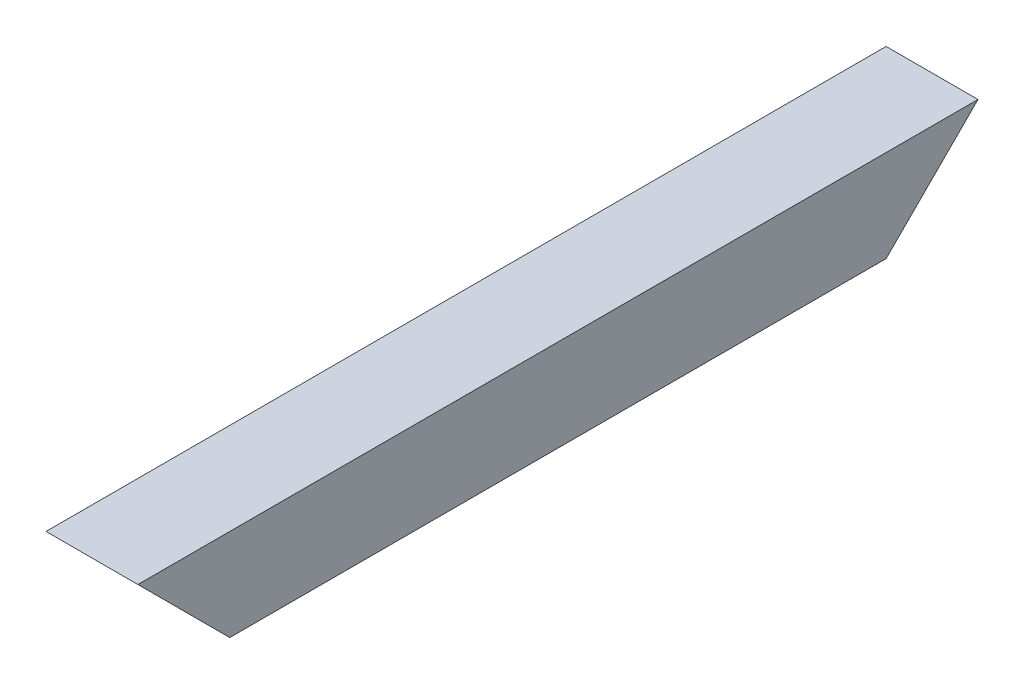
ISO-10303-21;
HEADER;
FILE_DESCRIPTION(('STEP AP214'),'2;1');
FILE_NAME('part.step','',(''),(''),'','','');
FILE_SCHEMA(('AUTOMOTIVE_DESIGN { 1 0 10303 214 1 1 1 1 }'));
ENDSEC;
DATA;
#1=APPLICATION_CONTEXT('core data for automotive mechanical design processes');
#2=APPLICATION_PROTOCOL_DEFINITION('international standard','automotive_design',2000,#1);
#3=PRODUCT_CONTEXT('',#1,'mechanical');
#4=PRODUCT('Part','Part','',(#3));
#5=PRODUCT_RELATED_PRODUCT_CATEGORY('part','',(#4));
#6=PRODUCT_DEFINITION_FORMATION('','',#4);
#7=PRODUCT_DEFINITION_CONTEXT('part definition',#1,'design');
#8=PRODUCT_DEFINITION('design','',#6,#7);
#9=PRODUCT_DEFINITION_SHAPE('','',#8);
#10=(LENGTH_UNIT() NAMED_UNIT(*) SI_UNIT(.MILLI.,.METRE.));
#11=(NAMED_UNIT(*) PLANE_ANGLE_UNIT() SI_UNIT($,.RADIAN.));
#12=(NAMED_UNIT(*) SI_UNIT($,.STERADIAN.) SOLID_ANGLE_UNIT());
#13=UNCERTAINTY_MEASURE_WITH_UNIT(LENGTH_MEASURE(1.E-05),#10,'distance_accuracy_value','');
#14=(GEOMETRIC_REPRESENTATION_CONTEXT(3) GLOBAL_UNCERTAINTY_ASSIGNED_CONTEXT((#13)) GLOBAL_UNIT_ASSIGNED_CONTEXT((#10,
#11,#12)) REPRESENTATION_CONTEXT('',''));
#15=CARTESIAN_POINT('',(0.,0.,0.));
#16=DIRECTION('',(0.,0.,1.));
#17=DIRECTION('',(1.,0.,0.));
#18=AXIS2_PLACEMENT_3D('',#15,#16,#17);
#19=CARTESIAN_POINT('',(0.,3.175,317.5));
#20=DIRECTION('',(0.,-1.,0.));
#21=DIRECTION('',(0.,0.,-1.));
#22=AXIS2_PLACEMENT_3D('',#19,#20,#21);
#23=PLANE('',#22);
#24=DIRECTION('',(1.,0.,0.));
#25=VECTOR('',#24,1.);
#26=CARTESIAN_POINT('',(0.,3.175,-3.175));
#27=LINE('',#26,#25);
#28=CARTESIAN_POINT('',(3.175,3.175,-3.17499999999999));
#29=VERTEX_POINT('',#28);
#30=CARTESIAN_POINT('',(41.275,3.175,-3.17499999999999));
#31=VERTEX_POINT('',#30);
#32=EDGE_CURVE('E123',#29,#31,#27,.T.);
#33=ORIENTED_EDGE('',*,*,#32,.F.);
#34=DIRECTION('',(0.,0.,-1.));
#35=VECTOR('',#34,1.);
#36=CARTESIAN_POINT('',(3.175,3.175,0.));
#37=LINE('',#36,#35);
#38=CARTESIAN_POINT('',(3.175,3.17499999999999,320.675));
#39=VERTEX_POINT('',#38);
#40=EDGE_CURVE('E91',#39,#29,#37,.T.);
#41=ORIENTED_EDGE('',*,*,#40,.F.);
#42=DIRECTION('',(1.,0.,0.));
#43=VECTOR('',#42,1.);
#44=CARTESIAN_POINT('',(0.,3.17499999999998,320.675));
#45=LINE('',#44,#43);
#46=CARTESIAN_POINT('',(41.275,3.17499999999999,320.675));
#47=VERTEX_POINT('',#46);
#48=EDGE_CURVE('E98',#47,#39,#45,.F.);
#49=ORIENTED_EDGE('',*,*,#48,.F.);
#50=DIRECTION('',(0.,0.,-1.));
#51=VECTOR('',#50,1.);
#52=CARTESIAN_POINT('',(41.275,3.175,0.));
#53=LINE('',#52,#51);
#54=EDGE_CURVE('E20',#47,#31,#53,.T.);
#55=ORIENTED_EDGE('',*,*,#54,.T.);
#56=EDGE_LOOP('',(#33,#41,#49,#55));
#57=FACE_BOUND('',#56,.T.);
#58=ADVANCED_FACE('F17',(#57),#23,.F.);
#59=CARTESIAN_POINT('',(41.275,0.,0.));
#60=DIRECTION('',(1.,0.,0.));
#61=DIRECTION('',(0.,0.,-1.));
#62=AXIS2_PLACEMENT_3D('',#59,#60,#61);
#63=PLANE('',#62);
#64=DIRECTION('',(0.,0.707106781186548,-0.707106781186548));
#65=VECTOR('',#64,1.);
#66=CARTESIAN_POINT('',(41.275,0.,0.));
#67=LINE('',#66,#65);
#68=CARTESIAN_POINT('',(41.275,41.275,-41.275));
#69=VERTEX_POINT('',#68);
#70=EDGE_CURVE('E129',#31,#69,#67,.T.);
#71=ORIENTED_EDGE('',*,*,#70,.F.);
#72=ORIENTED_EDGE('',*,*,#54,.F.);
#73=DIRECTION('',(0.,-0.707106781186548,-0.707106781186548));
#74=VECTOR('',#73,1.);
#75=CARTESIAN_POINT('',(41.275,44.45,361.95));
#76=LINE('',#75,#74);
#77=CARTESIAN_POINT('',(41.275,41.275,358.775));
#78=VERTEX_POINT('',#77);
#79=EDGE_CURVE('E93',#78,#47,#76,.T.);
#80=ORIENTED_EDGE('',*,*,#79,.F.);
#81=DIRECTION('',(0.,0.,1.));
#82=VECTOR('',#81,1.);
#83=CARTESIAN_POINT('',(41.275,41.275,-44.45));
#84=LINE('',#83,#82);
#85=EDGE_CURVE('E83',#78,#69,#84,.F.);
#86=ORIENTED_EDGE('',*,*,#85,.T.);
#87=EDGE_LOOP('',(#71,#72,#80,#86));
#88=FACE_BOUND('',#87,.T.);
#89=ADVANCED_FACE('F94',(#88),#63,.F.);
#90=CARTESIAN_POINT('',(0.,41.275,-44.45));
#91=DIRECTION('',(0.,1.,0.));
#92=DIRECTION('',(0.,0.,1.));
#93=AXIS2_PLACEMENT_3D('',#90,#91,#92);
#94=PLANE('',#93);
#95=DIRECTION('',(1.,0.,0.));
#96=VECTOR('',#95,1.);
#97=CARTESIAN_POINT('',(0.,41.275,-41.275));
#98=LINE('',#97,#96);
#99=CARTESIAN_POINT('',(3.175,41.275,-41.275));
#100=VERTEX_POINT('',#99);
#101=EDGE_CURVE('E87',#69,#100,#98,.F.);
#102=ORIENTED_EDGE('',*,*,#101,.F.);
#103=ORIENTED_EDGE('',*,*,#85,.F.);
#104=DIRECTION('',(1.,0.,0.));
#105=VECTOR('',#104,1.);
#106=CARTESIAN_POINT('',(0.,41.275,358.775));
#107=LINE('',#106,#105);
#108=CARTESIAN_POINT('',(3.175,41.275,358.775));
#109=VERTEX_POINT('',#108);
#110=EDGE_CURVE('E80',#109,#78,#107,.T.);
#111=ORIENTED_EDGE('',*,*,#110,.F.);
#112=DIRECTION('',(0.,0.,-1.));
#113=VECTOR('',#112,1.);
#114=CARTESIAN_POINT('',(3.175,41.275,0.));
#115=LINE('',#114,#113);
#116=EDGE_CURVE('E108',#100,#109,#115,.F.);
#117=ORIENTED_EDGE('',*,*,#116,.F.);
#118=EDGE_LOOP('',(#102,#103,#111,#117));
#119=FACE_BOUND('',#118,.T.);
#120=ADVANCED_FACE('F85',(#119),#94,.F.);
#121=CARTESIAN_POINT('',(3.175,0.,0.));
#122=DIRECTION('',(1.,0.,0.));
#123=DIRECTION('',(0.,0.,-1.));
#124=AXIS2_PLACEMENT_3D('',#121,#122,#123);
#125=PLANE('',#124);
#126=ORIENTED_EDGE('',*,*,#116,.T.);
#127=DIRECTION('',(0.,-0.707106781186548,-0.707106781186548));
#128=VECTOR('',#127,1.);
#129=CARTESIAN_POINT('',(3.175,44.45,361.95));
#130=LINE('',#129,#128);
#131=EDGE_CURVE('E104',#39,#109,#130,.F.);
#132=ORIENTED_EDGE('',*,*,#131,.F.);
#133=ORIENTED_EDGE('',*,*,#40,.T.);
#134=DIRECTION('',(0.,0.707106781186548,-0.707106781186548));
#135=VECTOR('',#134,1.);
#136=CARTESIAN_POINT('',(3.175,0.,0.));
#137=LINE('',#136,#135);
#138=EDGE_CURVE('E118',#100,#29,#137,.F.);
#139=ORIENTED_EDGE('',*,*,#138,.F.);
#140=EDGE_LOOP('',(#126,#132,#133,#139));
#141=FACE_BOUND('',#140,.T.);
#142=ADVANCED_FACE('F117',(#141),#125,.T.);
#143=CARTESIAN_POINT('',(0.,0.,317.5));
#144=DIRECTION('',(0.,-1.,0.));
#145=DIRECTION('',(0.,0.,-1.));
#146=AXIS2_PLACEMENT_3D('',#143,#144,#145);
#147=PLANE('',#146);
#148=DIRECTION('',(1.,0.,0.));
#149=VECTOR('',#148,1.);
#150=CARTESIAN_POINT('',(0.,0.,317.5));
#151=LINE('',#150,#149);
#152=CARTESIAN_POINT('',(0.,0.,317.5));
#153=VERTEX_POINT('',#152);
#154=CARTESIAN_POINT('',(44.45,0.,317.5));
#155=VERTEX_POINT('',#154);
#156=EDGE_CURVE('E105',#153,#155,#151,.T.);
#157=ORIENTED_EDGE('',*,*,#156,.F.);
#158=DIRECTION('',(0.,0.,-1.));
#159=VECTOR('',#158,1.);
#160=CARTESIAN_POINT('',(0.,0.,0.));
#161=LINE('',#160,#159);
#162=CARTESIAN_POINT('',(0.,0.,0.));
#163=VERTEX_POINT('',#162);
#164=EDGE_CURVE('E127',#153,#163,#161,.T.);
#165=ORIENTED_EDGE('',*,*,#164,.T.);
#166=DIRECTION('',(1.,0.,0.));
#167=VECTOR('',#166,1.);
#168=CARTESIAN_POINT('',(0.,0.,0.));
#169=LINE('',#168,#167);
#170=CARTESIAN_POINT('',(44.45,0.,0.));
#171=VERTEX_POINT('',#170);
#172=EDGE_CURVE('E135',#171,#163,#169,.F.);
#173=ORIENTED_EDGE('',*,*,#172,.F.);
#174=DIRECTION('',(0.,0.,-1.));
#175=VECTOR('',#174,1.);
#176=CARTESIAN_POINT('',(44.45,0.,0.));
#177=LINE('',#176,#175);
#178=EDGE_CURVE('E143',#155,#171,#177,.T.);
#179=ORIENTED_EDGE('',*,*,#178,.F.);
#180=EDGE_LOOP('',(#157,#165,#173,#179));
#181=FACE_BOUND('',#180,.T.);
#182=ADVANCED_FACE('F170',(#181),#147,.T.);
#183=CARTESIAN_POINT('',(0.,44.45,361.95));
#184=DIRECTION('',(0.,-0.707106781186548,0.707106781186548));
#185=DIRECTION('',(0.,-0.707106781186548,-0.707106781186548));
#186=AXIS2_PLACEMENT_3D('',#183,#184,#185);
#187=PLANE('',#186);
#188=ORIENTED_EDGE('',*,*,#48,.T.);
#189=ORIENTED_EDGE('',*,*,#131,.T.);
#190=ORIENTED_EDGE('',*,*,#110,.T.);
#191=ORIENTED_EDGE('',*,*,#79,.T.);
#192=EDGE_LOOP('',(#188,#189,#190,#191));
#193=FACE_BOUND('',#192,.T.);
#194=DIRECTION('',(1.,0.,0.));
#195=VECTOR('',#194,1.);
#196=CARTESIAN_POINT('',(0.,44.45,361.95));
#197=LINE('',#196,#195);
#198=CARTESIAN_POINT('',(0.,44.45,361.95));
#199=VERTEX_POINT('',#198);
#200=CARTESIAN_POINT('',(44.45,44.45,361.95));
#201=VERTEX_POINT('',#200);
#202=EDGE_CURVE('E244',#199,#201,#197,.T.);
#203=ORIENTED_EDGE('',*,*,#202,.F.);
#204=DIRECTION('',(0.,-0.707106781186547,-0.707106781186547));
#205=VECTOR('',#204,1.);
#206=CARTESIAN_POINT('',(0.,44.45,361.95));
#207=LINE('',#206,#205);
#208=EDGE_CURVE('E124',#199,#153,#207,.T.);
#209=ORIENTED_EDGE('',*,*,#208,.T.);
#210=ORIENTED_EDGE('',*,*,#156,.T.);
#211=DIRECTION('',(0.,-0.707106781186547,-0.707106781186547));
#212=VECTOR('',#211,1.);
#213=CARTESIAN_POINT('',(44.45,44.45,361.95));
#214=LINE('',#213,#212);
#215=EDGE_CURVE('E140',#201,#155,#214,.T.);
#216=ORIENTED_EDGE('',*,*,#215,.F.);
#217=EDGE_LOOP('',(#203,#209,#210,#216));
#218=FACE_BOUND('',#217,.T.);
#219=ADVANCED_FACE('F101',(#193,#218),#187,.T.);
#220=CARTESIAN_POINT('',(44.45,0.,0.));
#221=DIRECTION('',(1.,0.,0.));
#222=DIRECTION('',(0.,0.,-1.));
#223=AXIS2_PLACEMENT_3D('',#220,#221,#222);
#224=PLANE('',#223);
#225=DIRECTION('',(0.,0.,1.));
#226=VECTOR('',#225,1.);
#227=CARTESIAN_POINT('',(44.45,44.45,-44.45));
#228=LINE('',#227,#226);
#229=CARTESIAN_POINT('',(44.45,44.45,-44.45));
#230=VERTEX_POINT('',#229);
#231=EDGE_CURVE('E248',#201,#230,#228,.F.);
#232=ORIENTED_EDGE('',*,*,#231,.F.);
#233=ORIENTED_EDGE('',*,*,#215,.T.);
#234=ORIENTED_EDGE('',*,*,#178,.T.);
#235=DIRECTION('',(0.,0.707106781186548,-0.707106781186548));
#236=VECTOR('',#235,1.);
#237=CARTESIAN_POINT('',(44.45,0.,0.));
#238=LINE('',#237,#236);
#239=EDGE_CURVE('E137',#230,#171,#238,.F.);
#240=ORIENTED_EDGE('',*,*,#239,.F.);
#241=EDGE_LOOP('',(#232,#233,#234,#240));
#242=FACE_BOUND('',#241,.T.);
#243=ADVANCED_FACE('F164',(#242),#224,.T.);
#244=CARTESIAN_POINT('',(0.,0.,0.));
#245=DIRECTION('',(0.,-0.707106781186548,-0.707106781186548));
#246=DIRECTION('',(0.,0.707106781186548,-0.707106781186548));
#247=AXIS2_PLACEMENT_3D('',#244,#245,#246);
#248=PLANE('',#247);
#249=ORIENTED_EDGE('',*,*,#101,.T.);
#250=ORIENTED_EDGE('',*,*,#138,.T.);
#251=ORIENTED_EDGE('',*,*,#32,.T.);
#252=ORIENTED_EDGE('',*,*,#70,.T.);
#253=EDGE_LOOP('',(#249,#250,#251,#252));
#254=FACE_BOUND('',#253,.T.);
#255=ORIENTED_EDGE('',*,*,#172,.T.);
#256=DIRECTION('',(0.,0.707106781186547,-0.707106781186547));
#257=VECTOR('',#256,1.);
#258=CARTESIAN_POINT('',(0.,0.,0.));
#259=LINE('',#258,#257);
#260=CARTESIAN_POINT('',(0.,44.45,-44.45));
#261=VERTEX_POINT('',#260);
#262=EDGE_CURVE('E35',#163,#261,#259,.T.);
#263=ORIENTED_EDGE('',*,*,#262,.T.);
#264=DIRECTION('',(1.,0.,0.));
#265=VECTOR('',#264,1.);
#266=CARTESIAN_POINT('',(0.,44.45,-44.45));
#267=LINE('',#266,#265);
#268=EDGE_CURVE('E26',#230,#261,#267,.F.);
#269=ORIENTED_EDGE('',*,*,#268,.F.);
#270=ORIENTED_EDGE('',*,*,#239,.T.);
#271=EDGE_LOOP('',(#255,#263,#269,#270));
#272=FACE_BOUND('',#271,.T.);
#273=ADVANCED_FACE('F122',(#254,#272),#248,.T.);
#274=CARTESIAN_POINT('',(0.,0.,0.));
#275=DIRECTION('',(1.,0.,0.));
#276=DIRECTION('',(0.,0.,-1.));
#277=AXIS2_PLACEMENT_3D('',#274,#275,#276);
#278=PLANE('',#277);
#279=ORIENTED_EDGE('',*,*,#262,.F.);
#280=ORIENTED_EDGE('',*,*,#164,.F.);
#281=ORIENTED_EDGE('',*,*,#208,.F.);
#282=DIRECTION('',(0.,0.,1.));
#283=VECTOR('',#282,1.);
#284=CARTESIAN_POINT('',(0.,44.45,-44.45));
#285=LINE('',#284,#283);
#286=EDGE_CURVE('E11',#261,#199,#285,.T.);
#287=ORIENTED_EDGE('',*,*,#286,.F.);
#288=EDGE_LOOP('',(#279,#280,#281,#287));
#289=FACE_BOUND('',#288,.T.);
#290=ADVANCED_FACE('F152',(#289),#278,.F.);
#291=CARTESIAN_POINT('',(0.,44.45,-44.45));
#292=DIRECTION('',(0.,1.,0.));
#293=DIRECTION('',(0.,0.,1.));
#294=AXIS2_PLACEMENT_3D('',#291,#292,#293);
#295=PLANE('',#294);
#296=ORIENTED_EDGE('',*,*,#268,.T.);
#297=ORIENTED_EDGE('',*,*,#286,.T.);
#298=ORIENTED_EDGE('',*,*,#202,.T.);
#299=ORIENTED_EDGE('',*,*,#231,.T.);
#300=EDGE_LOOP('',(#296,#297,#298,#299));
#301=FACE_BOUND('',#300,.T.);
#302=ADVANCED_FACE('F150',(#301),#295,.T.);
#303=CLOSED_SHELL('',(#58,#89,#120,#142,#182,#219,#243,#273,#290,#302));
#304=MANIFOLD_SOLID_BREP('B1',#303);
#305=ADVANCED_BREP_SHAPE_REPRESENTATION('',(#18,#304),#14);
#306=SHAPE_DEFINITION_REPRESENTATION(#9,#305);
ENDSEC;
END-ISO-10303-21;
